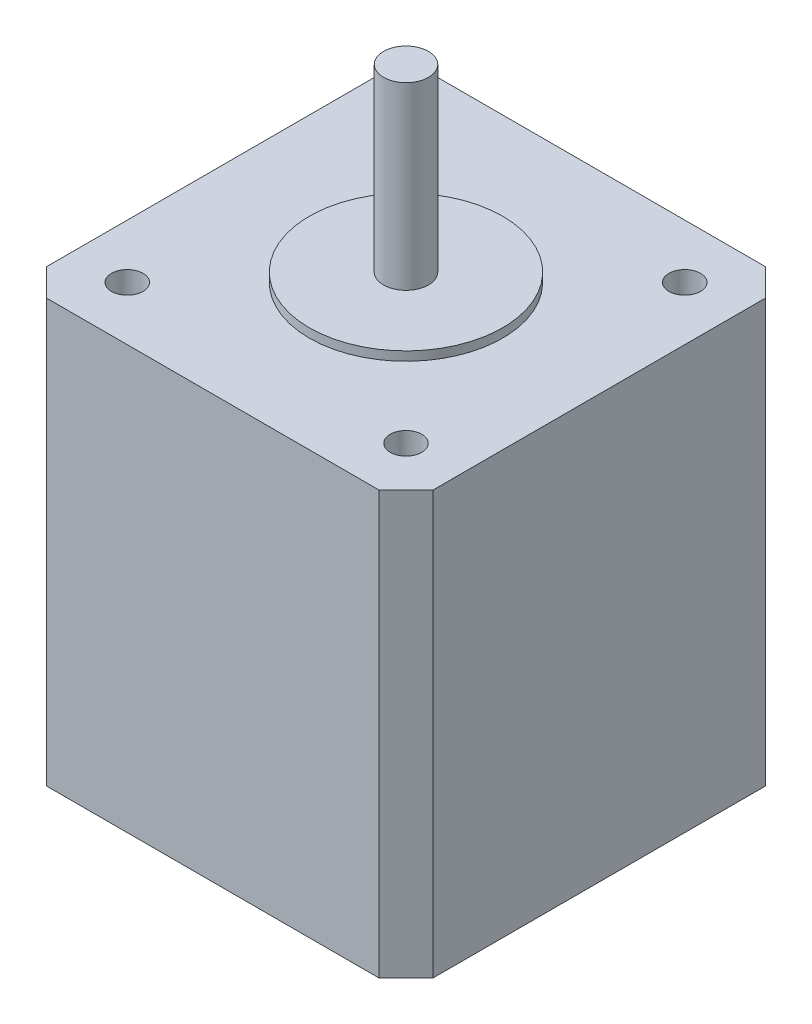
ISO-10303-21;
HEADER;
FILE_DESCRIPTION(('STEP AP214'),'2;1');
FILE_NAME('part.step','',(''),(''),'','','');
FILE_SCHEMA(('AUTOMOTIVE_DESIGN { 1 0 10303 214 1 1 1 1 }'));
ENDSEC;
DATA;
#1=APPLICATION_CONTEXT('core data for automotive mechanical design processes');
#2=APPLICATION_PROTOCOL_DEFINITION('international standard','automotive_design',2000,#1);
#3=PRODUCT_CONTEXT('',#1,'mechanical');
#4=PRODUCT('Part','Part','',(#3));
#5=PRODUCT_RELATED_PRODUCT_CATEGORY('part','',(#4));
#6=PRODUCT_DEFINITION_FORMATION('','',#4);
#7=PRODUCT_DEFINITION_CONTEXT('part definition',#1,'design');
#8=PRODUCT_DEFINITION('design','',#6,#7);
#9=PRODUCT_DEFINITION_SHAPE('','',#8);
#10=(LENGTH_UNIT() NAMED_UNIT(*) SI_UNIT(.MILLI.,.METRE.));
#11=(NAMED_UNIT(*) PLANE_ANGLE_UNIT() SI_UNIT($,.RADIAN.));
#12=(NAMED_UNIT(*) SI_UNIT($,.STERADIAN.) SOLID_ANGLE_UNIT());
#13=UNCERTAINTY_MEASURE_WITH_UNIT(LENGTH_MEASURE(1.E-05),#10,'distance_accuracy_value','');
#14=(GEOMETRIC_REPRESENTATION_CONTEXT(3) GLOBAL_UNCERTAINTY_ASSIGNED_CONTEXT((#13)) GLOBAL_UNIT_ASSIGNED_CONTEXT((#10,
#11,#12)) REPRESENTATION_CONTEXT('',''));
#15=CARTESIAN_POINT('',(0.,0.,0.));
#16=DIRECTION('',(0.,0.,1.));
#17=DIRECTION('',(1.,0.,0.));
#18=AXIS2_PLACEMENT_3D('',#15,#16,#17);
#19=CARTESIAN_POINT('',(0.,47.,0.));
#20=DIRECTION('',(1.,0.,0.));
#21=DIRECTION('',(0.,0.,-1.));
#22=AXIS2_PLACEMENT_3D('',#19,#20,#21);
#23=PLANE('',#22);
#24=DIRECTION('',(0.,0.,1.));
#25=VECTOR('',#24,1.);
#26=CARTESIAN_POINT('',(0.,47.,0.));
#27=LINE('',#26,#25);
#28=CARTESIAN_POINT('',(0.,47.,-40.));
#29=VERTEX_POINT('',#28);
#30=CARTESIAN_POINT('',(0.,47.,-3.00000000000002));
#31=VERTEX_POINT('',#30);
#32=EDGE_CURVE('E121',#29,#31,#27,.T.);
#33=ORIENTED_EDGE('',*,*,#32,.F.);
#34=DIRECTION('',(0.,-1.,0.));
#35=VECTOR('',#34,1.);
#36=CARTESIAN_POINT('',(0.,47.,-40.));
#37=LINE('',#36,#35);
#38=CARTESIAN_POINT('',(0.,0.,-40.));
#39=VERTEX_POINT('',#38);
#40=EDGE_CURVE('E106',#29,#39,#37,.T.);
#41=ORIENTED_EDGE('',*,*,#40,.T.);
#42=DIRECTION('',(0.,0.,1.));
#43=VECTOR('',#42,1.);
#44=CARTESIAN_POINT('',(0.,0.,0.));
#45=LINE('',#44,#43);
#46=CARTESIAN_POINT('',(0.,0.,-3.00000000000002));
#47=VERTEX_POINT('',#46);
#48=EDGE_CURVE('E118',#39,#47,#45,.T.);
#49=ORIENTED_EDGE('',*,*,#48,.T.);
#50=DIRECTION('',(0.,1.,0.));
#51=VECTOR('',#50,1.);
#52=CARTESIAN_POINT('',(0.,47.,-3.00000000000002));
#53=LINE('',#52,#51);
#54=EDGE_CURVE('E123',#47,#31,#53,.T.);
#55=ORIENTED_EDGE('',*,*,#54,.T.);
#56=EDGE_LOOP('',(#33,#41,#49,#55));
#57=FACE_BOUND('',#56,.T.);
#58=ADVANCED_FACE('F36',(#57),#23,.F.);
#59=CARTESIAN_POINT('',(0.,47.,0.));
#60=DIRECTION('',(0.,0.,-1.));
#61=DIRECTION('',(-1.,0.,0.));
#62=AXIS2_PLACEMENT_3D('',#59,#60,#61);
#63=PLANE('',#62);
#64=DIRECTION('',(1.,0.,0.));
#65=VECTOR('',#64,1.);
#66=CARTESIAN_POINT('',(0.,0.,0.));
#67=LINE('',#66,#65);
#68=CARTESIAN_POINT('',(3.,0.,0.));
#69=VERTEX_POINT('',#68);
#70=CARTESIAN_POINT('',(40.,0.,0.));
#71=VERTEX_POINT('',#70);
#72=EDGE_CURVE('E127',#69,#71,#67,.T.);
#73=ORIENTED_EDGE('',*,*,#72,.T.);
#74=DIRECTION('',(0.,1.,0.));
#75=VECTOR('',#74,1.);
#76=CARTESIAN_POINT('',(40.,47.,0.));
#77=LINE('',#76,#75);
#78=CARTESIAN_POINT('',(40.,47.,0.));
#79=VERTEX_POINT('',#78);
#80=EDGE_CURVE('E11',#71,#79,#77,.T.);
#81=ORIENTED_EDGE('',*,*,#80,.T.);
#82=DIRECTION('',(1.,0.,0.));
#83=VECTOR('',#82,1.);
#84=CARTESIAN_POINT('',(0.,47.,0.));
#85=LINE('',#84,#83);
#86=CARTESIAN_POINT('',(3.,47.,0.));
#87=VERTEX_POINT('',#86);
#88=EDGE_CURVE('E168',#87,#79,#85,.T.);
#89=ORIENTED_EDGE('',*,*,#88,.F.);
#90=DIRECTION('',(0.,-1.,0.));
#91=VECTOR('',#90,1.);
#92=CARTESIAN_POINT('',(3.,47.,0.));
#93=LINE('',#92,#91);
#94=EDGE_CURVE('E44',#87,#69,#93,.T.);
#95=ORIENTED_EDGE('',*,*,#94,.T.);
#96=EDGE_LOOP('',(#73,#81,#89,#95));
#97=FACE_BOUND('',#96,.T.);
#98=ADVANCED_FACE('F166',(#97),#63,.F.);
#99=CARTESIAN_POINT('',(43.,47.,0.));
#100=DIRECTION('',(-1.,0.,0.));
#101=DIRECTION('',(0.,0.,1.));
#102=AXIS2_PLACEMENT_3D('',#99,#100,#101);
#103=PLANE('',#102);
#104=DIRECTION('',(0.,0.,-1.));
#105=VECTOR('',#104,1.);
#106=CARTESIAN_POINT('',(43.,0.,0.));
#107=LINE('',#106,#105);
#108=CARTESIAN_POINT('',(43.,0.,-3.));
#109=VERTEX_POINT('',#108);
#110=CARTESIAN_POINT('',(43.,0.,-40.));
#111=VERTEX_POINT('',#110);
#112=EDGE_CURVE('E131',#109,#111,#107,.T.);
#113=ORIENTED_EDGE('',*,*,#112,.T.);
#114=DIRECTION('',(0.,1.,0.));
#115=VECTOR('',#114,1.);
#116=CARTESIAN_POINT('',(43.,47.,-40.));
#117=LINE('',#116,#115);
#118=CARTESIAN_POINT('',(43.,47.,-40.));
#119=VERTEX_POINT('',#118);
#120=EDGE_CURVE('E51',#111,#119,#117,.T.);
#121=ORIENTED_EDGE('',*,*,#120,.T.);
#122=DIRECTION('',(0.,0.,-1.));
#123=VECTOR('',#122,1.);
#124=CARTESIAN_POINT('',(43.,47.,0.));
#125=LINE('',#124,#123);
#126=CARTESIAN_POINT('',(43.,47.,-3.));
#127=VERTEX_POINT('',#126);
#128=EDGE_CURVE('E176',#127,#119,#125,.T.);
#129=ORIENTED_EDGE('',*,*,#128,.F.);
#130=DIRECTION('',(0.,-1.,0.));
#131=VECTOR('',#130,1.);
#132=CARTESIAN_POINT('',(43.,47.,-3.));
#133=LINE('',#132,#131);
#134=EDGE_CURVE('E159',#127,#109,#133,.T.);
#135=ORIENTED_EDGE('',*,*,#134,.T.);
#136=EDGE_LOOP('',(#113,#121,#129,#135));
#137=FACE_BOUND('',#136,.T.);
#138=ADVANCED_FACE('F175',(#137),#103,.F.);
#139=CARTESIAN_POINT('',(0.,47.,-43.));
#140=DIRECTION('',(0.,0.,1.));
#141=DIRECTION('',(1.,0.,0.));
#142=AXIS2_PLACEMENT_3D('',#139,#140,#141);
#143=PLANE('',#142);
#144=DIRECTION('',(-1.,0.,0.));
#145=VECTOR('',#144,1.);
#146=CARTESIAN_POINT('',(0.,0.,-43.));
#147=LINE('',#146,#145);
#148=CARTESIAN_POINT('',(40.,0.,-43.));
#149=VERTEX_POINT('',#148);
#150=CARTESIAN_POINT('',(3.00000000000002,0.,-43.));
#151=VERTEX_POINT('',#150);
#152=EDGE_CURVE('E141',#149,#151,#147,.T.);
#153=ORIENTED_EDGE('',*,*,#152,.T.);
#154=DIRECTION('',(0.,1.,0.));
#155=VECTOR('',#154,1.);
#156=CARTESIAN_POINT('',(3.00000000000002,47.,-43.));
#157=LINE('',#156,#155);
#158=CARTESIAN_POINT('',(3.00000000000002,47.,-43.));
#159=VERTEX_POINT('',#158);
#160=EDGE_CURVE('E107',#151,#159,#157,.T.);
#161=ORIENTED_EDGE('',*,*,#160,.T.);
#162=DIRECTION('',(-1.,0.,0.));
#163=VECTOR('',#162,1.);
#164=CARTESIAN_POINT('',(0.,47.,-43.));
#165=LINE('',#164,#163);
#166=CARTESIAN_POINT('',(40.,47.,-43.));
#167=VERTEX_POINT('',#166);
#168=EDGE_CURVE('E137',#167,#159,#165,.T.);
#169=ORIENTED_EDGE('',*,*,#168,.F.);
#170=DIRECTION('',(0.,-1.,0.));
#171=VECTOR('',#170,1.);
#172=CARTESIAN_POINT('',(40.,47.,-43.));
#173=LINE('',#172,#171);
#174=EDGE_CURVE('E112',#167,#149,#173,.T.);
#175=ORIENTED_EDGE('',*,*,#174,.T.);
#176=EDGE_LOOP('',(#153,#161,#169,#175));
#177=FACE_BOUND('',#176,.T.);
#178=ADVANCED_FACE('F226',(#177),#143,.F.);
#179=CARTESIAN_POINT('',(0.,47.,0.));
#180=DIRECTION('',(0.,-1.,0.));
#181=DIRECTION('',(0.,0.,-1.));
#182=AXIS2_PLACEMENT_3D('',#179,#180,#181);
#183=PLANE('',#182);
#184=CARTESIAN_POINT('',(6.00000000000008,47.,-37.0000000000001));
#185=DIRECTION('',(0.,1.,0.));
#186=DIRECTION('',(0.,0.,1.));
#187=AXIS2_PLACEMENT_3D('',#184,#185,#186);
#188=CIRCLE('',#187,1.75);
#189=CARTESIAN_POINT('',(6.00000000000008,47.,-35.2500000000001));
#190=VERTEX_POINT('',#189);
#191=EDGE_CURVE('E203',#190,#190,#188,.T.);
#192=ORIENTED_EDGE('',*,*,#191,.F.);
#193=EDGE_LOOP('',(#192));
#194=FACE_BOUND('',#193,.T.);
#195=CARTESIAN_POINT('',(37.,47.,-6.));
#196=DIRECTION('',(0.,1.,0.));
#197=DIRECTION('',(0.,0.,1.));
#198=AXIS2_PLACEMENT_3D('',#195,#196,#197);
#199=CIRCLE('',#198,1.75);
#200=CARTESIAN_POINT('',(37.,47.,-4.25));
#201=VERTEX_POINT('',#200);
#202=EDGE_CURVE('E196',#201,#201,#199,.T.);
#203=ORIENTED_EDGE('',*,*,#202,.F.);
#204=EDGE_LOOP('',(#203));
#205=FACE_BOUND('',#204,.T.);
#206=CARTESIAN_POINT('',(37.,47.,-37.));
#207=DIRECTION('',(0.,1.,0.));
#208=DIRECTION('',(0.,0.,1.));
#209=AXIS2_PLACEMENT_3D('',#206,#207,#208);
#210=CIRCLE('',#209,1.75);
#211=CARTESIAN_POINT('',(37.,47.,-35.25));
#212=VERTEX_POINT('',#211);
#213=EDGE_CURVE('E208',#212,#212,#210,.T.);
#214=ORIENTED_EDGE('',*,*,#213,.F.);
#215=EDGE_LOOP('',(#214));
#216=FACE_BOUND('',#215,.T.);
#217=CARTESIAN_POINT('',(6.00000000000007,47.,-6.00000000000008));
#218=DIRECTION('',(0.,1.,0.));
#219=DIRECTION('',(0.,0.,1.));
#220=AXIS2_PLACEMENT_3D('',#217,#218,#219);
#221=CIRCLE('',#220,1.75);
#222=CARTESIAN_POINT('',(6.00000000000007,47.,-4.25000000000008));
#223=VERTEX_POINT('',#222);
#224=EDGE_CURVE('E190',#223,#223,#221,.T.);
#225=ORIENTED_EDGE('',*,*,#224,.F.);
#226=EDGE_LOOP('',(#225));
#227=FACE_BOUND('',#226,.T.);
#228=CARTESIAN_POINT('',(21.5,47.,-21.5));
#229=DIRECTION('',(0.,1.,0.));
#230=DIRECTION('',(0.,0.,1.));
#231=AXIS2_PLACEMENT_3D('',#228,#229,#230);
#232=CIRCLE('',#231,10.75);
#233=CARTESIAN_POINT('',(21.5,47.,-10.75));
#234=VERTEX_POINT('',#233);
#235=EDGE_CURVE('E179',#234,#234,#232,.T.);
#236=ORIENTED_EDGE('',*,*,#235,.F.);
#237=EDGE_LOOP('',(#236));
#238=FACE_BOUND('',#237,.T.);
#239=ORIENTED_EDGE('',*,*,#168,.T.);
#240=DIRECTION('',(0.707106781186549,0.,-0.707106781186546));
#241=VECTOR('',#240,1.);
#242=CARTESIAN_POINT('',(0.,47.,-40.));
#243=LINE('',#242,#241);
#244=EDGE_CURVE('E157',#159,#29,#243,.F.);
#245=ORIENTED_EDGE('',*,*,#244,.T.);
#246=ORIENTED_EDGE('',*,*,#32,.T.);
#247=DIRECTION('',(-0.707106781186546,0.,-0.707106781186549));
#248=VECTOR('',#247,1.);
#249=CARTESIAN_POINT('',(3.,47.,0.));
#250=LINE('',#249,#248);
#251=EDGE_CURVE('E152',#31,#87,#250,.F.);
#252=ORIENTED_EDGE('',*,*,#251,.T.);
#253=ORIENTED_EDGE('',*,*,#88,.T.);
#254=DIRECTION('',(-0.707106781186549,0.,0.707106781186546));
#255=VECTOR('',#254,1.);
#256=CARTESIAN_POINT('',(43.,47.,-3.));
#257=LINE('',#256,#255);
#258=EDGE_CURVE('E58',#79,#127,#257,.F.);
#259=ORIENTED_EDGE('',*,*,#258,.T.);
#260=ORIENTED_EDGE('',*,*,#128,.T.);
#261=DIRECTION('',(0.707106781186546,0.,0.707106781186549));
#262=VECTOR('',#261,1.);
#263=CARTESIAN_POINT('',(40.,47.,-43.));
#264=LINE('',#263,#262);
#265=EDGE_CURVE('E155',#119,#167,#264,.F.);
#266=ORIENTED_EDGE('',*,*,#265,.T.);
#267=EDGE_LOOP('',(#239,#245,#246,#252,#253,#259,#260,#266));
#268=FACE_BOUND('',#267,.T.);
#269=ADVANCED_FACE('F223',(#194,#205,#216,#227,#238,#268),#183,.F.);
#270=CARTESIAN_POINT('',(0.,0.,0.));
#271=DIRECTION('',(0.,-1.,0.));
#272=DIRECTION('',(0.,0.,-1.));
#273=AXIS2_PLACEMENT_3D('',#270,#271,#272);
#274=PLANE('',#273);
#275=ORIENTED_EDGE('',*,*,#48,.F.);
#276=DIRECTION('',(-0.707106781186549,0.,0.707106781186546));
#277=VECTOR('',#276,1.);
#278=CARTESIAN_POINT('',(-20.,0.,-20.0000000000001));
#279=LINE('',#278,#277);
#280=EDGE_CURVE('E102',#39,#151,#279,.F.);
#281=ORIENTED_EDGE('',*,*,#280,.T.);
#282=ORIENTED_EDGE('',*,*,#152,.F.);
#283=DIRECTION('',(-0.707106781186546,0.,-0.707106781186549));
#284=VECTOR('',#283,1.);
#285=CARTESIAN_POINT('',(41.5000000000001,0.,-41.4999999999999));
#286=LINE('',#285,#284);
#287=EDGE_CURVE('E113',#149,#111,#286,.F.);
#288=ORIENTED_EDGE('',*,*,#287,.T.);
#289=ORIENTED_EDGE('',*,*,#112,.F.);
#290=DIRECTION('',(0.707106781186549,0.,-0.707106781186546));
#291=VECTOR('',#290,1.);
#292=CARTESIAN_POINT('',(19.9999999999999,0.,20.));
#293=LINE('',#292,#291);
#294=EDGE_CURVE('E146',#109,#71,#293,.F.);
#295=ORIENTED_EDGE('',*,*,#294,.T.);
#296=ORIENTED_EDGE('',*,*,#72,.F.);
#297=DIRECTION('',(0.707106781186546,0.,0.707106781186549));
#298=VECTOR('',#297,1.);
#299=CARTESIAN_POINT('',(1.50000000000001,0.,-1.5));
#300=LINE('',#299,#298);
#301=EDGE_CURVE('E122',#69,#47,#300,.F.);
#302=ORIENTED_EDGE('',*,*,#301,.T.);
#303=EDGE_LOOP('',(#275,#281,#282,#288,#289,#295,#296,#302));
#304=FACE_BOUND('',#303,.T.);
#305=ADVANCED_FACE('F125',(#304),#274,.T.);
#306=CARTESIAN_POINT('',(21.5,48.,-21.5));
#307=DIRECTION('',(0.,-1.,0.));
#308=DIRECTION('',(0.,0.,-1.));
#309=AXIS2_PLACEMENT_3D('',#306,#307,#308);
#310=CYLINDRICAL_SURFACE('',#309,10.75);
#311=CARTESIAN_POINT('',(21.5,48.,-21.5));
#312=DIRECTION('',(0.,1.,0.));
#313=DIRECTION('',(0.,0.,1.));
#314=AXIS2_PLACEMENT_3D('',#311,#312,#313);
#315=CIRCLE('',#314,10.75);
#316=CARTESIAN_POINT('',(21.5,48.,-10.75));
#317=VERTEX_POINT('',#316);
#318=EDGE_CURVE('E128',#317,#317,#315,.T.);
#319=ORIENTED_EDGE('',*,*,#318,.F.);
#320=EDGE_LOOP('',(#319));
#321=FACE_BOUND('',#320,.T.);
#322=ORIENTED_EDGE('',*,*,#235,.T.);
#323=EDGE_LOOP('',(#322));
#324=FACE_BOUND('',#323,.T.);
#325=ADVANCED_FACE('F257',(#321,#324),#310,.T.);
#326=CARTESIAN_POINT('',(21.5,48.,-21.5));
#327=DIRECTION('',(0.,1.,0.));
#328=DIRECTION('',(0.,0.,1.));
#329=AXIS2_PLACEMENT_3D('',#326,#327,#328);
#330=PLANE('',#329);
#331=CARTESIAN_POINT('',(21.5,48.,-21.5));
#332=DIRECTION('',(0.,1.,0.));
#333=DIRECTION('',(0.,0.,1.));
#334=AXIS2_PLACEMENT_3D('',#331,#332,#333);
#335=CIRCLE('',#334,2.5);
#336=CARTESIAN_POINT('',(21.5,48.,-19.));
#337=VERTEX_POINT('',#336);
#338=EDGE_CURVE('E143',#337,#337,#335,.T.);
#339=ORIENTED_EDGE('',*,*,#338,.F.);
#340=EDGE_LOOP('',(#339));
#341=FACE_BOUND('',#340,.T.);
#342=ORIENTED_EDGE('',*,*,#318,.T.);
#343=EDGE_LOOP('',(#342));
#344=FACE_BOUND('',#343,.T.);
#345=ADVANCED_FACE('F261',(#341,#344),#330,.T.);
#346=CARTESIAN_POINT('',(21.5,68.,-21.5));
#347=DIRECTION('',(0.,-1.,0.));
#348=DIRECTION('',(0.,0.,-1.));
#349=AXIS2_PLACEMENT_3D('',#346,#347,#348);
#350=CYLINDRICAL_SURFACE('',#349,2.5);
#351=CARTESIAN_POINT('',(21.5,68.,-21.5));
#352=DIRECTION('',(0.,1.,0.));
#353=DIRECTION('',(0.,0.,1.));
#354=AXIS2_PLACEMENT_3D('',#351,#352,#353);
#355=CIRCLE('',#354,2.5);
#356=CARTESIAN_POINT('',(21.5,68.,-19.));
#357=VERTEX_POINT('',#356);
#358=EDGE_CURVE('E134',#357,#357,#355,.T.);
#359=ORIENTED_EDGE('',*,*,#358,.F.);
#360=EDGE_LOOP('',(#359));
#361=FACE_BOUND('',#360,.T.);
#362=ORIENTED_EDGE('',*,*,#338,.T.);
#363=EDGE_LOOP('',(#362));
#364=FACE_BOUND('',#363,.T.);
#365=ADVANCED_FACE('F265',(#361,#364),#350,.T.);
#366=CARTESIAN_POINT('',(21.5,68.,-21.5));
#367=DIRECTION('',(0.,1.,0.));
#368=DIRECTION('',(0.,0.,1.));
#369=AXIS2_PLACEMENT_3D('',#366,#367,#368);
#370=PLANE('',#369);
#371=ORIENTED_EDGE('',*,*,#358,.T.);
#372=EDGE_LOOP('',(#371));
#373=FACE_BOUND('',#372,.T.);
#374=ADVANCED_FACE('F243',(#373),#370,.T.);
#375=CARTESIAN_POINT('',(0.,47.,-40.));
#376=DIRECTION('',(0.707106781186546,0.,0.707106781186549));
#377=DIRECTION('',(0.,-1.,0.));
#378=AXIS2_PLACEMENT_3D('',#375,#376,#377);
#379=PLANE('',#378);
#380=ORIENTED_EDGE('',*,*,#244,.F.);
#381=ORIENTED_EDGE('',*,*,#160,.F.);
#382=ORIENTED_EDGE('',*,*,#280,.F.);
#383=ORIENTED_EDGE('',*,*,#40,.F.);
#384=EDGE_LOOP('',(#380,#381,#382,#383));
#385=FACE_BOUND('',#384,.T.);
#386=ADVANCED_FACE('F105',(#385),#379,.F.);
#387=CARTESIAN_POINT('',(40.,47.,-43.));
#388=DIRECTION('',(-0.707106781186549,0.,0.707106781186546));
#389=DIRECTION('',(0.,-1.,0.));
#390=AXIS2_PLACEMENT_3D('',#387,#388,#389);
#391=PLANE('',#390);
#392=ORIENTED_EDGE('',*,*,#265,.F.);
#393=ORIENTED_EDGE('',*,*,#120,.F.);
#394=ORIENTED_EDGE('',*,*,#287,.F.);
#395=ORIENTED_EDGE('',*,*,#174,.F.);
#396=EDGE_LOOP('',(#392,#393,#394,#395));
#397=FACE_BOUND('',#396,.T.);
#398=ADVANCED_FACE('F236',(#397),#391,.F.);
#399=CARTESIAN_POINT('',(43.,47.,-3.));
#400=DIRECTION('',(-0.707106781186546,0.,-0.707106781186549));
#401=DIRECTION('',(0.,-1.,0.));
#402=AXIS2_PLACEMENT_3D('',#399,#400,#401);
#403=PLANE('',#402);
#404=ORIENTED_EDGE('',*,*,#258,.F.);
#405=ORIENTED_EDGE('',*,*,#80,.F.);
#406=ORIENTED_EDGE('',*,*,#294,.F.);
#407=ORIENTED_EDGE('',*,*,#134,.F.);
#408=EDGE_LOOP('',(#404,#405,#406,#407));
#409=FACE_BOUND('',#408,.T.);
#410=ADVANCED_FACE('F174',(#409),#403,.F.);
#411=CARTESIAN_POINT('',(3.,47.,0.));
#412=DIRECTION('',(0.707106781186549,0.,-0.707106781186546));
#413=DIRECTION('',(0.,-1.,0.));
#414=AXIS2_PLACEMENT_3D('',#411,#412,#413);
#415=PLANE('',#414);
#416=ORIENTED_EDGE('',*,*,#251,.F.);
#417=ORIENTED_EDGE('',*,*,#54,.F.);
#418=ORIENTED_EDGE('',*,*,#301,.F.);
#419=ORIENTED_EDGE('',*,*,#94,.F.);
#420=EDGE_LOOP('',(#416,#417,#418,#419));
#421=FACE_BOUND('',#420,.T.);
#422=ADVANCED_FACE('F38',(#421),#415,.F.);
#423=CARTESIAN_POINT('',(6.00000000000007,37.,-6.00000000000008));
#424=DIRECTION('',(0.,1.,0.));
#425=DIRECTION('',(0.,0.,1.));
#426=AXIS2_PLACEMENT_3D('',#423,#424,#425);
#427=CYLINDRICAL_SURFACE('',#426,1.75);
#428=CARTESIAN_POINT('',(6.00000000000007,37.,-6.00000000000008));
#429=DIRECTION('',(0.,1.,0.));
#430=DIRECTION('',(0.,0.,1.));
#431=AXIS2_PLACEMENT_3D('',#428,#429,#430);
#432=CIRCLE('',#431,1.75);
#433=CARTESIAN_POINT('',(6.00000000000007,37.,-4.25000000000008));
#434=VERTEX_POINT('',#433);
#435=EDGE_CURVE('E189',#434,#434,#432,.T.);
#436=ORIENTED_EDGE('',*,*,#435,.F.);
#437=EDGE_LOOP('',(#436));
#438=FACE_BOUND('',#437,.T.);
#439=ORIENTED_EDGE('',*,*,#224,.T.);
#440=EDGE_LOOP('',(#439));
#441=FACE_BOUND('',#440,.T.);
#442=ADVANCED_FACE('F273',(#438,#441),#427,.F.);
#443=CARTESIAN_POINT('',(6.00000000000007,37.,-6.00000000000008));
#444=DIRECTION('',(0.,1.,0.));
#445=DIRECTION('',(0.,0.,1.));
#446=AXIS2_PLACEMENT_3D('',#443,#444,#445);
#447=PLANE('',#446);
#448=ORIENTED_EDGE('',*,*,#435,.T.);
#449=EDGE_LOOP('',(#448));
#450=FACE_BOUND('',#449,.T.);
#451=ADVANCED_FACE('F219',(#450),#447,.T.);
#452=CARTESIAN_POINT('',(37.,37.,-37.));
#453=DIRECTION('',(0.,1.,0.));
#454=DIRECTION('',(0.,0.,1.));
#455=AXIS2_PLACEMENT_3D('',#452,#453,#454);
#456=CYLINDRICAL_SURFACE('',#455,1.75);
#457=CARTESIAN_POINT('',(37.,37.,-37.));
#458=DIRECTION('',(0.,1.,0.));
#459=DIRECTION('',(0.,0.,1.));
#460=AXIS2_PLACEMENT_3D('',#457,#458,#459);
#461=CIRCLE('',#460,1.75);
#462=CARTESIAN_POINT('',(37.,37.,-35.25));
#463=VERTEX_POINT('',#462);
#464=EDGE_CURVE('E200',#463,#463,#461,.T.);
#465=ORIENTED_EDGE('',*,*,#464,.F.);
#466=EDGE_LOOP('',(#465));
#467=FACE_BOUND('',#466,.T.);
#468=ORIENTED_EDGE('',*,*,#213,.T.);
#469=EDGE_LOOP('',(#468));
#470=FACE_BOUND('',#469,.T.);
#471=ADVANCED_FACE('F216',(#467,#470),#456,.F.);
#472=CARTESIAN_POINT('',(37.,37.,-37.));
#473=DIRECTION('',(0.,1.,0.));
#474=DIRECTION('',(0.,0.,1.));
#475=AXIS2_PLACEMENT_3D('',#472,#473,#474);
#476=PLANE('',#475);
#477=ORIENTED_EDGE('',*,*,#464,.T.);
#478=EDGE_LOOP('',(#477));
#479=FACE_BOUND('',#478,.T.);
#480=ADVANCED_FACE('F214',(#479),#476,.T.);
#481=CARTESIAN_POINT('',(37.,37.,-6.));
#482=DIRECTION('',(0.,1.,0.));
#483=DIRECTION('',(0.,0.,1.));
#484=AXIS2_PLACEMENT_3D('',#481,#482,#483);
#485=CYLINDRICAL_SURFACE('',#484,1.75);
#486=CARTESIAN_POINT('',(37.,37.,-6.));
#487=DIRECTION('',(0.,1.,0.));
#488=DIRECTION('',(0.,0.,1.));
#489=AXIS2_PLACEMENT_3D('',#486,#487,#488);
#490=CIRCLE('',#489,1.75);
#491=CARTESIAN_POINT('',(37.,37.,-4.25));
#492=VERTEX_POINT('',#491);
#493=EDGE_CURVE('E199',#492,#492,#490,.T.);
#494=ORIENTED_EDGE('',*,*,#493,.F.);
#495=EDGE_LOOP('',(#494));
#496=FACE_BOUND('',#495,.T.);
#497=ORIENTED_EDGE('',*,*,#202,.T.);
#498=EDGE_LOOP('',(#497));
#499=FACE_BOUND('',#498,.T.);
#500=ADVANCED_FACE('F280',(#496,#499),#485,.F.);
#501=CARTESIAN_POINT('',(37.,37.,-6.));
#502=DIRECTION('',(0.,1.,0.));
#503=DIRECTION('',(0.,0.,1.));
#504=AXIS2_PLACEMENT_3D('',#501,#502,#503);
#505=PLANE('',#504);
#506=ORIENTED_EDGE('',*,*,#493,.T.);
#507=EDGE_LOOP('',(#506));
#508=FACE_BOUND('',#507,.T.);
#509=ADVANCED_FACE('F283',(#508),#505,.T.);
#510=CARTESIAN_POINT('',(6.00000000000008,37.,-37.0000000000001));
#511=DIRECTION('',(0.,1.,0.));
#512=DIRECTION('',(0.,0.,1.));
#513=AXIS2_PLACEMENT_3D('',#510,#511,#512);
#514=CYLINDRICAL_SURFACE('',#513,1.75);
#515=CARTESIAN_POINT('',(6.00000000000008,37.,-37.0000000000001));
#516=DIRECTION('',(0.,1.,0.));
#517=DIRECTION('',(0.,0.,1.));
#518=AXIS2_PLACEMENT_3D('',#515,#516,#517);
#519=CIRCLE('',#518,1.75);
#520=CARTESIAN_POINT('',(6.00000000000008,37.,-35.2500000000001));
#521=VERTEX_POINT('',#520);
#522=EDGE_CURVE('E193',#521,#521,#519,.T.);
#523=ORIENTED_EDGE('',*,*,#522,.F.);
#524=EDGE_LOOP('',(#523));
#525=FACE_BOUND('',#524,.T.);
#526=ORIENTED_EDGE('',*,*,#191,.T.);
#527=EDGE_LOOP('',(#526));
#528=FACE_BOUND('',#527,.T.);
#529=ADVANCED_FACE('F287',(#525,#528),#514,.F.);
#530=CARTESIAN_POINT('',(6.00000000000008,37.,-37.0000000000001));
#531=DIRECTION('',(0.,1.,0.));
#532=DIRECTION('',(0.,0.,1.));
#533=AXIS2_PLACEMENT_3D('',#530,#531,#532);
#534=PLANE('',#533);
#535=ORIENTED_EDGE('',*,*,#522,.T.);
#536=EDGE_LOOP('',(#535));
#537=FACE_BOUND('',#536,.T.);
#538=ADVANCED_FACE('F291',(#537),#534,.T.);
#539=CLOSED_SHELL('',(#58,#98,#138,#178,#269,#305,#325,#345,#365,#374,#386,#398,#410,#422,#442,
#451,#471,#480,#500,#509,#529,#538));
#540=MANIFOLD_SOLID_BREP('B2',#539);
#541=ADVANCED_BREP_SHAPE_REPRESENTATION('',(#18,#540),#14);
#542=SHAPE_DEFINITION_REPRESENTATION(#9,#541);
ENDSEC;
END-ISO-10303-21;
